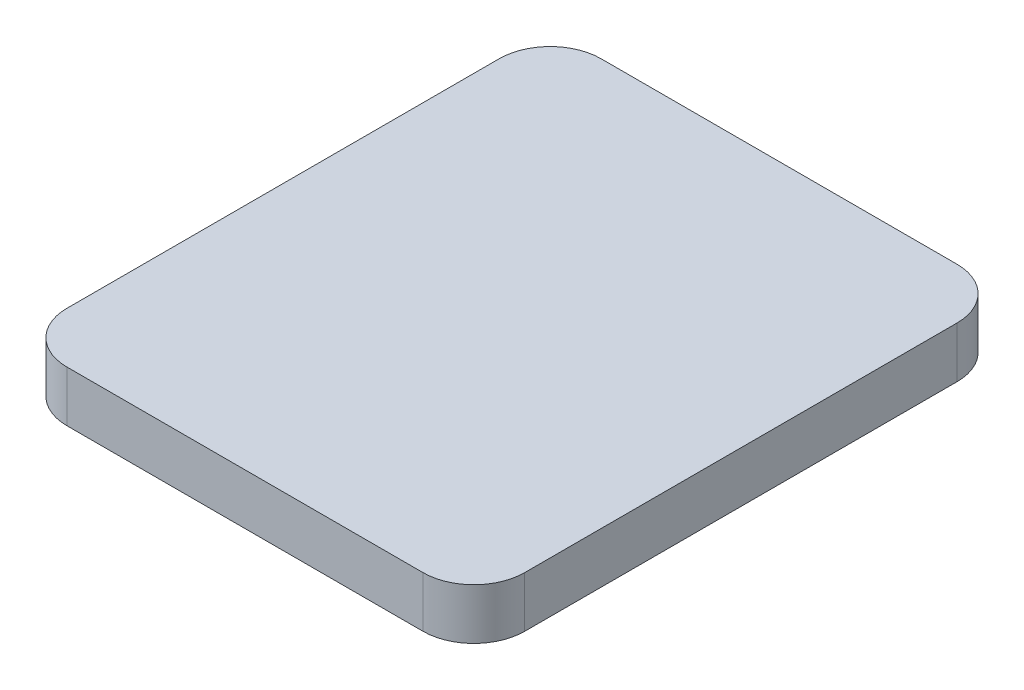
ISO-10303-21;
HEADER;
FILE_DESCRIPTION(('STEP AP214'),'2;1');
FILE_NAME('part.step','',(''),(''),'','','');
FILE_SCHEMA(('AUTOMOTIVE_DESIGN { 1 0 10303 214 1 1 1 1 }'));
ENDSEC;
DATA;
#1=APPLICATION_CONTEXT('core data for automotive mechanical design processes');
#2=APPLICATION_PROTOCOL_DEFINITION('international standard','automotive_design',2000,#1);
#3=PRODUCT_CONTEXT('',#1,'mechanical');
#4=PRODUCT('Part','Part','',(#3));
#5=PRODUCT_RELATED_PRODUCT_CATEGORY('part','',(#4));
#6=PRODUCT_DEFINITION_FORMATION('','',#4);
#7=PRODUCT_DEFINITION_CONTEXT('part definition',#1,'design');
#8=PRODUCT_DEFINITION('design','',#6,#7);
#9=PRODUCT_DEFINITION_SHAPE('','',#8);
#10=(LENGTH_UNIT() NAMED_UNIT(*) SI_UNIT(.MILLI.,.METRE.));
#11=(NAMED_UNIT(*) PLANE_ANGLE_UNIT() SI_UNIT($,.RADIAN.));
#12=(NAMED_UNIT(*) SI_UNIT($,.STERADIAN.) SOLID_ANGLE_UNIT());
#13=UNCERTAINTY_MEASURE_WITH_UNIT(LENGTH_MEASURE(1.E-05),#10,'distance_accuracy_value','');
#14=(GEOMETRIC_REPRESENTATION_CONTEXT(3) GLOBAL_UNCERTAINTY_ASSIGNED_CONTEXT((#13)) GLOBAL_UNIT_ASSIGNED_CONTEXT((#10,
#11,#12)) REPRESENTATION_CONTEXT('',''));
#15=CARTESIAN_POINT('',(0.,0.,0.));
#16=DIRECTION('',(0.,0.,1.));
#17=DIRECTION('',(1.,0.,0.));
#18=AXIS2_PLACEMENT_3D('',#15,#16,#17);
#19=CARTESIAN_POINT('',(9.,2.,-10.5));
#20=DIRECTION('',(-1.,0.,0.));
#21=DIRECTION('',(0.,0.,1.));
#22=AXIS2_PLACEMENT_3D('',#19,#20,#21);
#23=PLANE('',#22);
#24=DIRECTION('',(0.,0.,-1.));
#25=VECTOR('',#24,1.);
#26=CARTESIAN_POINT('',(9.,0.,-10.5));
#27=LINE('',#26,#25);
#28=CARTESIAN_POINT('',(9.,0.,8.5));
#29=VERTEX_POINT('',#28);
#30=CARTESIAN_POINT('',(9.,0.,-8.49999999999999));
#31=VERTEX_POINT('',#30);
#32=EDGE_CURVE('E140',#29,#31,#27,.T.);
#33=ORIENTED_EDGE('',*,*,#32,.T.);
#34=DIRECTION('',(0.,-1.,0.));
#35=VECTOR('',#34,1.);
#36=CARTESIAN_POINT('',(9.,2.,-8.49999999999999));
#37=LINE('',#36,#35);
#38=CARTESIAN_POINT('',(9.,2.,-8.49999999999999));
#39=VERTEX_POINT('',#38);
#40=EDGE_CURVE('E174',#31,#39,#37,.F.);
#41=ORIENTED_EDGE('',*,*,#40,.T.);
#42=DIRECTION('',(0.,0.,-1.));
#43=VECTOR('',#42,1.);
#44=CARTESIAN_POINT('',(9.,2.,-10.5));
#45=LINE('',#44,#43);
#46=CARTESIAN_POINT('',(9.,2.,8.5));
#47=VERTEX_POINT('',#46);
#48=EDGE_CURVE('E138',#47,#39,#45,.T.);
#49=ORIENTED_EDGE('',*,*,#48,.F.);
#50=DIRECTION('',(0.,-1.,0.));
#51=VECTOR('',#50,1.);
#52=CARTESIAN_POINT('',(9.,2.,8.50000000000001));
#53=LINE('',#52,#51);
#54=EDGE_CURVE('E170',#47,#29,#53,.T.);
#55=ORIENTED_EDGE('',*,*,#54,.T.);
#56=EDGE_LOOP('',(#33,#41,#49,#55));
#57=FACE_BOUND('',#56,.T.);
#58=ADVANCED_FACE('F39',(#57),#23,.F.);
#59=CARTESIAN_POINT('',(-9.,2.,-10.5));
#60=DIRECTION('',(0.,0.,1.));
#61=DIRECTION('',(1.,0.,0.));
#62=AXIS2_PLACEMENT_3D('',#59,#60,#61);
#63=PLANE('',#62);
#64=DIRECTION('',(-1.,0.,0.));
#65=VECTOR('',#64,1.);
#66=CARTESIAN_POINT('',(-9.,0.,-10.5));
#67=LINE('',#66,#65);
#68=CARTESIAN_POINT('',(7.,0.,-10.5));
#69=VERTEX_POINT('',#68);
#70=CARTESIAN_POINT('',(-7.,0.,-10.5));
#71=VERTEX_POINT('',#70);
#72=EDGE_CURVE('E134',#69,#71,#67,.T.);
#73=ORIENTED_EDGE('',*,*,#72,.T.);
#74=DIRECTION('',(0.,-1.,0.));
#75=VECTOR('',#74,1.);
#76=CARTESIAN_POINT('',(-7.,2.,-10.5));
#77=LINE('',#76,#75);
#78=CARTESIAN_POINT('',(-7.,2.,-10.5));
#79=VERTEX_POINT('',#78);
#80=EDGE_CURVE('E110',#71,#79,#77,.F.);
#81=ORIENTED_EDGE('',*,*,#80,.T.);
#82=DIRECTION('',(-1.,0.,0.));
#83=VECTOR('',#82,1.);
#84=CARTESIAN_POINT('',(-9.,2.,-10.5));
#85=LINE('',#84,#83);
#86=CARTESIAN_POINT('',(7.,2.,-10.5));
#87=VERTEX_POINT('',#86);
#88=EDGE_CURVE('E193',#87,#79,#85,.T.);
#89=ORIENTED_EDGE('',*,*,#88,.F.);
#90=DIRECTION('',(0.,-1.,0.));
#91=VECTOR('',#90,1.);
#92=CARTESIAN_POINT('',(7.,2.,-10.5));
#93=LINE('',#92,#91);
#94=EDGE_CURVE('E116',#87,#69,#93,.T.);
#95=ORIENTED_EDGE('',*,*,#94,.T.);
#96=EDGE_LOOP('',(#73,#81,#89,#95));
#97=FACE_BOUND('',#96,.T.);
#98=ADVANCED_FACE('F214',(#97),#63,.F.);
#99=CARTESIAN_POINT('',(-9.,2.,-10.5));
#100=DIRECTION('',(1.,0.,0.));
#101=DIRECTION('',(0.,0.,-1.));
#102=AXIS2_PLACEMENT_3D('',#99,#100,#101);
#103=PLANE('',#102);
#104=DIRECTION('',(0.,0.,1.));
#105=VECTOR('',#104,1.);
#106=CARTESIAN_POINT('',(-9.,2.,-10.5));
#107=LINE('',#106,#105);
#108=CARTESIAN_POINT('',(-9.,2.,-8.49999999999999));
#109=VERTEX_POINT('',#108);
#110=CARTESIAN_POINT('',(-9.,2.,8.5));
#111=VERTEX_POINT('',#110);
#112=EDGE_CURVE('E125',#109,#111,#107,.T.);
#113=ORIENTED_EDGE('',*,*,#112,.F.);
#114=DIRECTION('',(0.,-1.,0.));
#115=VECTOR('',#114,1.);
#116=CARTESIAN_POINT('',(-9.,2.,-8.49999999999999));
#117=LINE('',#116,#115);
#118=CARTESIAN_POINT('',(-9.,0.,-8.49999999999999));
#119=VERTEX_POINT('',#118);
#120=EDGE_CURVE('E109',#109,#119,#117,.T.);
#121=ORIENTED_EDGE('',*,*,#120,.T.);
#122=DIRECTION('',(0.,0.,1.));
#123=VECTOR('',#122,1.);
#124=CARTESIAN_POINT('',(-9.,0.,-10.5));
#125=LINE('',#124,#123);
#126=CARTESIAN_POINT('',(-9.,0.,8.5));
#127=VERTEX_POINT('',#126);
#128=EDGE_CURVE('E123',#119,#127,#125,.T.);
#129=ORIENTED_EDGE('',*,*,#128,.T.);
#130=DIRECTION('',(0.,-1.,0.));
#131=VECTOR('',#130,1.);
#132=CARTESIAN_POINT('',(-9.,2.,8.50000000000001));
#133=LINE('',#132,#131);
#134=EDGE_CURVE('E128',#127,#111,#133,.F.);
#135=ORIENTED_EDGE('',*,*,#134,.T.);
#136=EDGE_LOOP('',(#113,#121,#129,#135));
#137=FACE_BOUND('',#136,.T.);
#138=ADVANCED_FACE('F122',(#137),#103,.F.);
#139=CARTESIAN_POINT('',(-9.,2.,10.5));
#140=DIRECTION('',(0.,0.,-1.));
#141=DIRECTION('',(-1.,0.,0.));
#142=AXIS2_PLACEMENT_3D('',#139,#140,#141);
#143=PLANE('',#142);
#144=DIRECTION('',(1.,0.,0.));
#145=VECTOR('',#144,1.);
#146=CARTESIAN_POINT('',(-9.,0.,10.5));
#147=LINE('',#146,#145);
#148=CARTESIAN_POINT('',(-7.,0.,10.5));
#149=VERTEX_POINT('',#148);
#150=CARTESIAN_POINT('',(7.,0.,10.5));
#151=VERTEX_POINT('',#150);
#152=EDGE_CURVE('E133',#149,#151,#147,.T.);
#153=ORIENTED_EDGE('',*,*,#152,.T.);
#154=DIRECTION('',(0.,-1.,0.));
#155=VECTOR('',#154,1.);
#156=CARTESIAN_POINT('',(7.,2.,10.5));
#157=LINE('',#156,#155);
#158=CARTESIAN_POINT('',(7.,2.,10.5));
#159=VERTEX_POINT('',#158);
#160=EDGE_CURVE('E11',#151,#159,#157,.F.);
#161=ORIENTED_EDGE('',*,*,#160,.T.);
#162=DIRECTION('',(1.,0.,0.));
#163=VECTOR('',#162,1.);
#164=CARTESIAN_POINT('',(-9.,2.,10.5));
#165=LINE('',#164,#163);
#166=CARTESIAN_POINT('',(-7.,2.,10.5));
#167=VERTEX_POINT('',#166);
#168=EDGE_CURVE('E145',#167,#159,#165,.T.);
#169=ORIENTED_EDGE('',*,*,#168,.F.);
#170=DIRECTION('',(0.,-1.,0.));
#171=VECTOR('',#170,1.);
#172=CARTESIAN_POINT('',(-7.,2.,10.5));
#173=LINE('',#172,#171);
#174=EDGE_CURVE('E48',#167,#149,#173,.T.);
#175=ORIENTED_EDGE('',*,*,#174,.T.);
#176=EDGE_LOOP('',(#153,#161,#169,#175));
#177=FACE_BOUND('',#176,.T.);
#178=ADVANCED_FACE('F179',(#177),#143,.F.);
#179=CARTESIAN_POINT('',(0.,2.,0.));
#180=DIRECTION('',(0.,1.,0.));
#181=DIRECTION('',(0.,0.,1.));
#182=AXIS2_PLACEMENT_3D('',#179,#180,#181);
#183=PLANE('',#182);
#184=ORIENTED_EDGE('',*,*,#88,.T.);
#185=CARTESIAN_POINT('',(-7.,2.,-8.49999999999999));
#186=DIRECTION('',(0.,1.,0.));
#187=DIRECTION('',(0.,0.,1.));
#188=AXIS2_PLACEMENT_3D('',#185,#186,#187);
#189=CIRCLE('',#188,2.);
#190=EDGE_CURVE('E167',#79,#109,#189,.T.);
#191=ORIENTED_EDGE('',*,*,#190,.T.);
#192=ORIENTED_EDGE('',*,*,#112,.T.);
#193=CARTESIAN_POINT('',(-7.,2.,8.50000000000001));
#194=DIRECTION('',(0.,1.,0.));
#195=DIRECTION('',(0.,0.,1.));
#196=AXIS2_PLACEMENT_3D('',#193,#194,#195);
#197=CIRCLE('',#196,2.);
#198=EDGE_CURVE('E60',#111,#167,#197,.T.);
#199=ORIENTED_EDGE('',*,*,#198,.T.);
#200=ORIENTED_EDGE('',*,*,#168,.T.);
#201=CARTESIAN_POINT('',(7.,2.,8.50000000000001));
#202=DIRECTION('',(0.,1.,0.));
#203=DIRECTION('',(0.,0.,1.));
#204=AXIS2_PLACEMENT_3D('',#201,#202,#203);
#205=CIRCLE('',#204,2.);
#206=EDGE_CURVE('E161',#159,#47,#205,.T.);
#207=ORIENTED_EDGE('',*,*,#206,.T.);
#208=ORIENTED_EDGE('',*,*,#48,.T.);
#209=CARTESIAN_POINT('',(7.,2.,-8.49999999999999));
#210=DIRECTION('',(0.,1.,0.));
#211=DIRECTION('',(0.,0.,1.));
#212=AXIS2_PLACEMENT_3D('',#209,#210,#211);
#213=CIRCLE('',#212,2.);
#214=EDGE_CURVE('E164',#39,#87,#213,.T.);
#215=ORIENTED_EDGE('',*,*,#214,.T.);
#216=EDGE_LOOP('',(#184,#191,#192,#199,#200,#207,#208,#215));
#217=FACE_BOUND('',#216,.T.);
#218=ADVANCED_FACE('F203',(#217),#183,.T.);
#219=CARTESIAN_POINT('',(0.,0.,0.));
#220=DIRECTION('',(0.,1.,0.));
#221=DIRECTION('',(0.,0.,1.));
#222=AXIS2_PLACEMENT_3D('',#219,#220,#221);
#223=PLANE('',#222);
#224=ORIENTED_EDGE('',*,*,#128,.F.);
#225=CARTESIAN_POINT('',(-7.,0.,-8.49999999999999));
#226=DIRECTION('',(0.,1.,0.));
#227=DIRECTION('',(0.,0.,1.));
#228=AXIS2_PLACEMENT_3D('',#225,#226,#227);
#229=CIRCLE('',#228,2.);
#230=EDGE_CURVE('E105',#119,#71,#229,.F.);
#231=ORIENTED_EDGE('',*,*,#230,.T.);
#232=ORIENTED_EDGE('',*,*,#72,.F.);
#233=CARTESIAN_POINT('',(7.,0.,-8.49999999999999));
#234=DIRECTION('',(0.,1.,0.));
#235=DIRECTION('',(0.,0.,1.));
#236=AXIS2_PLACEMENT_3D('',#233,#234,#235);
#237=CIRCLE('',#236,2.);
#238=EDGE_CURVE('E117',#69,#31,#237,.F.);
#239=ORIENTED_EDGE('',*,*,#238,.T.);
#240=ORIENTED_EDGE('',*,*,#32,.F.);
#241=CARTESIAN_POINT('',(7.,0.,8.50000000000001));
#242=DIRECTION('',(0.,1.,0.));
#243=DIRECTION('',(0.,0.,1.));
#244=AXIS2_PLACEMENT_3D('',#241,#242,#243);
#245=CIRCLE('',#244,2.);
#246=EDGE_CURVE('E149',#29,#151,#245,.F.);
#247=ORIENTED_EDGE('',*,*,#246,.T.);
#248=ORIENTED_EDGE('',*,*,#152,.F.);
#249=CARTESIAN_POINT('',(-7.,0.,8.50000000000001));
#250=DIRECTION('',(0.,1.,0.));
#251=DIRECTION('',(0.,0.,1.));
#252=AXIS2_PLACEMENT_3D('',#249,#250,#251);
#253=CIRCLE('',#252,2.);
#254=EDGE_CURVE('E127',#149,#127,#253,.F.);
#255=ORIENTED_EDGE('',*,*,#254,.T.);
#256=EDGE_LOOP('',(#224,#231,#232,#239,#240,#247,#248,#255));
#257=FACE_BOUND('',#256,.T.);
#258=ADVANCED_FACE('F130',(#257),#223,.F.);
#259=CARTESIAN_POINT('',(-7.,2.,-8.49999999999999));
#260=DIRECTION('',(0.,-1.,0.));
#261=DIRECTION('',(0.,0.,-1.));
#262=AXIS2_PLACEMENT_3D('',#259,#260,#261);
#263=CYLINDRICAL_SURFACE('',#262,2.);
#264=ORIENTED_EDGE('',*,*,#190,.F.);
#265=ORIENTED_EDGE('',*,*,#80,.F.);
#266=ORIENTED_EDGE('',*,*,#230,.F.);
#267=ORIENTED_EDGE('',*,*,#120,.F.);
#268=EDGE_LOOP('',(#264,#265,#266,#267));
#269=FACE_BOUND('',#268,.T.);
#270=ADVANCED_FACE('F108',(#269),#263,.T.);
#271=CARTESIAN_POINT('',(7.,2.,-8.49999999999999));
#272=DIRECTION('',(0.,-1.,0.));
#273=DIRECTION('',(0.,0.,-1.));
#274=AXIS2_PLACEMENT_3D('',#271,#272,#273);
#275=CYLINDRICAL_SURFACE('',#274,2.);
#276=ORIENTED_EDGE('',*,*,#214,.F.);
#277=ORIENTED_EDGE('',*,*,#40,.F.);
#278=ORIENTED_EDGE('',*,*,#238,.F.);
#279=ORIENTED_EDGE('',*,*,#94,.F.);
#280=EDGE_LOOP('',(#276,#277,#278,#279));
#281=FACE_BOUND('',#280,.T.);
#282=ADVANCED_FACE('F225',(#281),#275,.T.);
#283=CARTESIAN_POINT('',(7.,2.,8.50000000000001));
#284=DIRECTION('',(0.,-1.,0.));
#285=DIRECTION('',(0.,0.,-1.));
#286=AXIS2_PLACEMENT_3D('',#283,#284,#285);
#287=CYLINDRICAL_SURFACE('',#286,2.);
#288=ORIENTED_EDGE('',*,*,#206,.F.);
#289=ORIENTED_EDGE('',*,*,#160,.F.);
#290=ORIENTED_EDGE('',*,*,#246,.F.);
#291=ORIENTED_EDGE('',*,*,#54,.F.);
#292=EDGE_LOOP('',(#288,#289,#290,#291));
#293=FACE_BOUND('',#292,.T.);
#294=ADVANCED_FACE('F186',(#293),#287,.T.);
#295=CARTESIAN_POINT('',(-7.,2.,8.50000000000001));
#296=DIRECTION('',(0.,-1.,0.));
#297=DIRECTION('',(0.,0.,-1.));
#298=AXIS2_PLACEMENT_3D('',#295,#296,#297);
#299=CYLINDRICAL_SURFACE('',#298,2.);
#300=ORIENTED_EDGE('',*,*,#198,.F.);
#301=ORIENTED_EDGE('',*,*,#134,.F.);
#302=ORIENTED_EDGE('',*,*,#254,.F.);
#303=ORIENTED_EDGE('',*,*,#174,.F.);
#304=EDGE_LOOP('',(#300,#301,#302,#303));
#305=FACE_BOUND('',#304,.T.);
#306=ADVANCED_FACE('F41',(#305),#299,.T.);
#307=CLOSED_SHELL('',(#58,#98,#138,#178,#218,#258,#270,#282,#294,#306));
#308=MANIFOLD_SOLID_BREP('B2',#307);
#309=ADVANCED_BREP_SHAPE_REPRESENTATION('',(#18,#308),#14);
#310=SHAPE_DEFINITION_REPRESENTATION(#9,#309);
ENDSEC;
END-ISO-10303-21;
